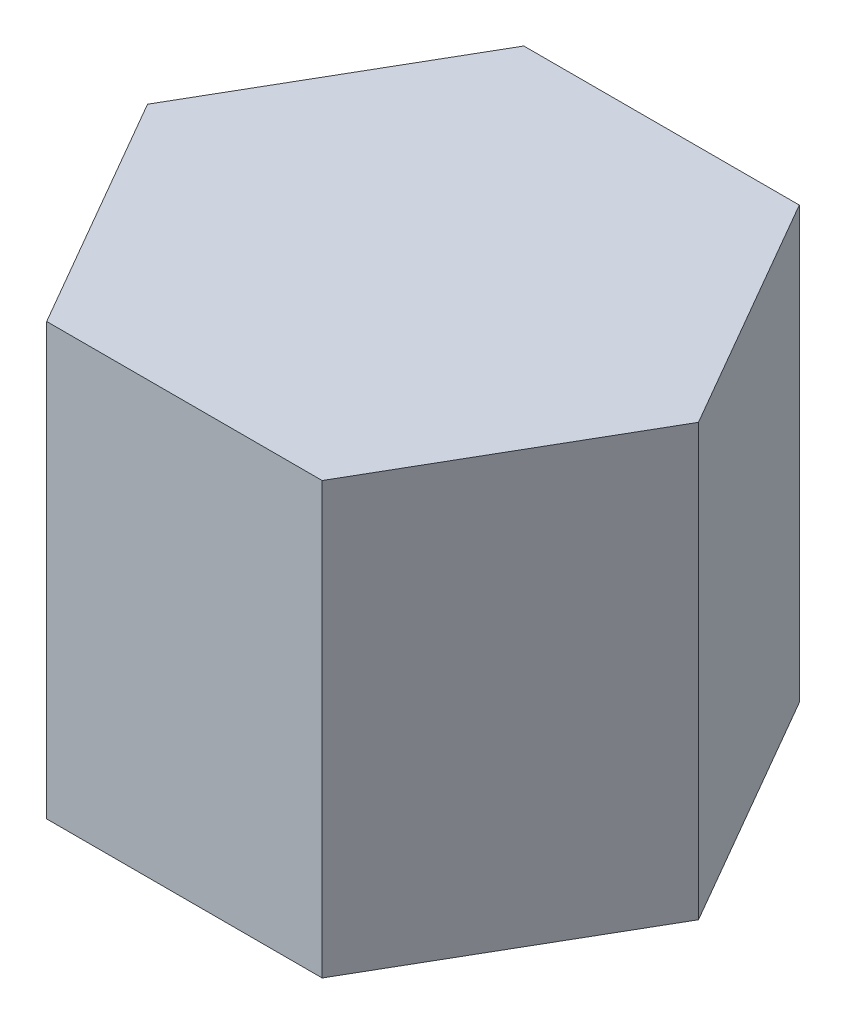
ISO-10303-21;
HEADER;
FILE_DESCRIPTION(('STEP AP214'),'2;1');
FILE_NAME('part.step','',(''),(''),'','','');
FILE_SCHEMA(('AUTOMOTIVE_DESIGN { 1 0 10303 214 1 1 1 1 }'));
ENDSEC;
DATA;
#1=APPLICATION_CONTEXT('core data for automotive mechanical design processes');
#2=APPLICATION_PROTOCOL_DEFINITION('international standard','automotive_design',2000,#1);
#3=PRODUCT_CONTEXT('',#1,'mechanical');
#4=PRODUCT('Part','Part','',(#3));
#5=PRODUCT_RELATED_PRODUCT_CATEGORY('part','',(#4));
#6=PRODUCT_DEFINITION_FORMATION('','',#4);
#7=PRODUCT_DEFINITION_CONTEXT('part definition',#1,'design');
#8=PRODUCT_DEFINITION('design','',#6,#7);
#9=PRODUCT_DEFINITION_SHAPE('','',#8);
#10=(LENGTH_UNIT() NAMED_UNIT(*) SI_UNIT(.MILLI.,.METRE.));
#11=(NAMED_UNIT(*) PLANE_ANGLE_UNIT() SI_UNIT($,.RADIAN.));
#12=(NAMED_UNIT(*) SI_UNIT($,.STERADIAN.) SOLID_ANGLE_UNIT());
#13=UNCERTAINTY_MEASURE_WITH_UNIT(LENGTH_MEASURE(1.E-05),#10,'distance_accuracy_value','');
#14=(GEOMETRIC_REPRESENTATION_CONTEXT(3) GLOBAL_UNCERTAINTY_ASSIGNED_CONTEXT((#13)) GLOBAL_UNIT_ASSIGNED_CONTEXT((#10,
#11,#12)) REPRESENTATION_CONTEXT('',''));
#15=CARTESIAN_POINT('',(0.,0.,0.));
#16=DIRECTION('',(0.,0.,1.));
#17=DIRECTION('',(1.,0.,0.));
#18=AXIS2_PLACEMENT_3D('',#15,#16,#17);
#19=CARTESIAN_POINT('',(-25.5766169251004,-80.,44.3));
#20=DIRECTION('',(0.,0.,1.));
#21=DIRECTION('',(1.,0.,0.));
#22=AXIS2_PLACEMENT_3D('',#19,#20,#21);
#23=PLANE('',#22);
#24=DIRECTION('',(1.,0.,0.));
#25=VECTOR('',#24,1.);
#26=CARTESIAN_POINT('',(-25.5766169251004,0.,44.3));
#27=LINE('',#26,#25);
#28=CARTESIAN_POINT('',(-25.5766169251004,0.,44.3));
#29=VERTEX_POINT('',#28);
#30=CARTESIAN_POINT('',(25.5766169251004,0.,44.3));
#31=VERTEX_POINT('',#30);
#32=EDGE_CURVE('E130',#29,#31,#27,.T.);
#33=ORIENTED_EDGE('',*,*,#32,.F.);
#34=DIRECTION('',(0.,1.,0.));
#35=VECTOR('',#34,1.);
#36=CARTESIAN_POINT('',(-25.5766169251004,-80.,44.3));
#37=LINE('',#36,#35);
#38=CARTESIAN_POINT('',(-25.5766169251004,-80.,44.3));
#39=VERTEX_POINT('',#38);
#40=EDGE_CURVE('E11',#39,#29,#37,.T.);
#41=ORIENTED_EDGE('',*,*,#40,.F.);
#42=DIRECTION('',(1.,0.,0.));
#43=VECTOR('',#42,1.);
#44=CARTESIAN_POINT('',(-25.5766169251004,-80.,44.3));
#45=LINE('',#44,#43);
#46=CARTESIAN_POINT('',(25.5766169251004,-80.,44.3));
#47=VERTEX_POINT('',#46);
#48=EDGE_CURVE('E150',#39,#47,#45,.T.);
#49=ORIENTED_EDGE('',*,*,#48,.T.);
#50=DIRECTION('',(0.,1.,0.));
#51=VECTOR('',#50,1.);
#52=CARTESIAN_POINT('',(25.5766169251004,-80.,44.3));
#53=LINE('',#52,#51);
#54=EDGE_CURVE('E42',#47,#31,#53,.T.);
#55=ORIENTED_EDGE('',*,*,#54,.T.);
#56=EDGE_LOOP('',(#33,#41,#49,#55));
#57=FACE_BOUND('',#56,.T.);
#58=ADVANCED_FACE('F39',(#57),#23,.T.);
#59=CARTESIAN_POINT('',(-51.1532338502008,-80.,0.));
#60=DIRECTION('',(-0.866025403784439,0.,0.5));
#61=DIRECTION('',(0.5,0.,0.866025403784439));
#62=AXIS2_PLACEMENT_3D('',#59,#60,#61);
#63=PLANE('',#62);
#64=DIRECTION('',(0.5,0.,0.866025403784438));
#65=VECTOR('',#64,1.);
#66=CARTESIAN_POINT('',(-51.1532338502008,0.,0.));
#67=LINE('',#66,#65);
#68=CARTESIAN_POINT('',(-51.1532338502008,0.,0.));
#69=VERTEX_POINT('',#68);
#70=EDGE_CURVE('E147',#69,#29,#67,.T.);
#71=ORIENTED_EDGE('',*,*,#70,.F.);
#72=DIRECTION('',(0.,1.,0.));
#73=VECTOR('',#72,1.);
#74=CARTESIAN_POINT('',(-51.1532338502008,-80.,0.));
#75=LINE('',#74,#73);
#76=CARTESIAN_POINT('',(-51.1532338502008,-80.,0.));
#77=VERTEX_POINT('',#76);
#78=EDGE_CURVE('E49',#77,#69,#75,.T.);
#79=ORIENTED_EDGE('',*,*,#78,.F.);
#80=DIRECTION('',(0.5,0.,0.866025403784438));
#81=VECTOR('',#80,1.);
#82=CARTESIAN_POINT('',(-51.1532338502008,-80.,0.));
#83=LINE('',#82,#81);
#84=EDGE_CURVE('E116',#77,#39,#83,.T.);
#85=ORIENTED_EDGE('',*,*,#84,.T.);
#86=ORIENTED_EDGE('',*,*,#40,.T.);
#87=EDGE_LOOP('',(#71,#79,#85,#86));
#88=FACE_BOUND('',#87,.T.);
#89=ADVANCED_FACE('F162',(#88),#63,.T.);
#90=CARTESIAN_POINT('',(-25.5766169251004,-80.,-44.3));
#91=DIRECTION('',(-0.866025403784439,0.,-0.499999999999999));
#92=DIRECTION('',(-0.499999999999999,0.,0.866025403784439));
#93=AXIS2_PLACEMENT_3D('',#90,#91,#92);
#94=PLANE('',#93);
#95=DIRECTION('',(-0.499999999999999,0.,0.866025403784439));
#96=VECTOR('',#95,1.);
#97=CARTESIAN_POINT('',(-25.5766169251004,0.,-44.3));
#98=LINE('',#97,#96);
#99=CARTESIAN_POINT('',(-25.5766169251004,0.,-44.3));
#100=VERTEX_POINT('',#99);
#101=EDGE_CURVE('E102',#100,#69,#98,.T.);
#102=ORIENTED_EDGE('',*,*,#101,.F.);
#103=DIRECTION('',(0.,1.,0.));
#104=VECTOR('',#103,1.);
#105=CARTESIAN_POINT('',(-25.5766169251004,-80.,-44.3));
#106=LINE('',#105,#104);
#107=CARTESIAN_POINT('',(-25.5766169251004,-80.,-44.3));
#108=VERTEX_POINT('',#107);
#109=EDGE_CURVE('E97',#108,#100,#106,.T.);
#110=ORIENTED_EDGE('',*,*,#109,.F.);
#111=DIRECTION('',(-0.499999999999999,0.,0.866025403784439));
#112=VECTOR('',#111,1.);
#113=CARTESIAN_POINT('',(-25.5766169251004,-80.,-44.3));
#114=LINE('',#113,#112);
#115=EDGE_CURVE('E100',#108,#77,#114,.T.);
#116=ORIENTED_EDGE('',*,*,#115,.T.);
#117=ORIENTED_EDGE('',*,*,#78,.T.);
#118=EDGE_LOOP('',(#102,#110,#116,#117));
#119=FACE_BOUND('',#118,.T.);
#120=ADVANCED_FACE('F99',(#119),#94,.T.);
#121=CARTESIAN_POINT('',(25.5766169251004,-80.,-44.3));
#122=DIRECTION('',(0.,0.,-1.));
#123=DIRECTION('',(-1.,0.,0.));
#124=AXIS2_PLACEMENT_3D('',#121,#122,#123);
#125=PLANE('',#124);
#126=DIRECTION('',(-1.,0.,0.));
#127=VECTOR('',#126,1.);
#128=CARTESIAN_POINT('',(25.5766169251004,0.,-44.3));
#129=LINE('',#128,#127);
#130=CARTESIAN_POINT('',(25.5766169251004,0.,-44.3));
#131=VERTEX_POINT('',#130);
#132=EDGE_CURVE('E142',#131,#100,#129,.T.);
#133=ORIENTED_EDGE('',*,*,#132,.F.);
#134=DIRECTION('',(0.,1.,0.));
#135=VECTOR('',#134,1.);
#136=CARTESIAN_POINT('',(25.5766169251004,-80.,-44.3));
#137=LINE('',#136,#135);
#138=CARTESIAN_POINT('',(25.5766169251004,-80.,-44.3));
#139=VERTEX_POINT('',#138);
#140=EDGE_CURVE('E108',#139,#131,#137,.T.);
#141=ORIENTED_EDGE('',*,*,#140,.F.);
#142=DIRECTION('',(-1.,0.,0.));
#143=VECTOR('',#142,1.);
#144=CARTESIAN_POINT('',(25.5766169251004,-80.,-44.3));
#145=LINE('',#144,#143);
#146=EDGE_CURVE('E114',#139,#108,#145,.T.);
#147=ORIENTED_EDGE('',*,*,#146,.T.);
#148=ORIENTED_EDGE('',*,*,#109,.T.);
#149=EDGE_LOOP('',(#133,#141,#147,#148));
#150=FACE_BOUND('',#149,.T.);
#151=ADVANCED_FACE('F119',(#150),#125,.T.);
#152=CARTESIAN_POINT('',(51.1532338502008,-80.,0.));
#153=DIRECTION('',(0.866025403784438,0.,-0.5));
#154=DIRECTION('',(-0.5,0.,-0.866025403784438));
#155=AXIS2_PLACEMENT_3D('',#152,#153,#154);
#156=PLANE('',#155);
#157=DIRECTION('',(-0.5,0.,-0.866025403784438));
#158=VECTOR('',#157,1.);
#159=CARTESIAN_POINT('',(51.1532338502008,0.,0.));
#160=LINE('',#159,#158);
#161=CARTESIAN_POINT('',(51.1532338502008,0.,0.));
#162=VERTEX_POINT('',#161);
#163=EDGE_CURVE('E138',#162,#131,#160,.T.);
#164=ORIENTED_EDGE('',*,*,#163,.F.);
#165=DIRECTION('',(0.,1.,0.));
#166=VECTOR('',#165,1.);
#167=CARTESIAN_POINT('',(51.1532338502008,-80.,0.));
#168=LINE('',#167,#166);
#169=CARTESIAN_POINT('',(51.1532338502008,-80.,0.));
#170=VERTEX_POINT('',#169);
#171=EDGE_CURVE('E155',#170,#162,#168,.T.);
#172=ORIENTED_EDGE('',*,*,#171,.F.);
#173=DIRECTION('',(-0.5,0.,-0.866025403784438));
#174=VECTOR('',#173,1.);
#175=CARTESIAN_POINT('',(51.1532338502008,-80.,0.));
#176=LINE('',#175,#174);
#177=EDGE_CURVE('E121',#170,#139,#176,.T.);
#178=ORIENTED_EDGE('',*,*,#177,.T.);
#179=ORIENTED_EDGE('',*,*,#140,.T.);
#180=EDGE_LOOP('',(#164,#172,#178,#179));
#181=FACE_BOUND('',#180,.T.);
#182=ADVANCED_FACE('F175',(#181),#156,.T.);
#183=CARTESIAN_POINT('',(25.5766169251004,-80.,44.3));
#184=DIRECTION('',(0.866025403784439,0.,0.5));
#185=DIRECTION('',(0.5,0.,-0.866025403784439));
#186=AXIS2_PLACEMENT_3D('',#183,#184,#185);
#187=PLANE('',#186);
#188=DIRECTION('',(0.5,0.,-0.866025403784439));
#189=VECTOR('',#188,1.);
#190=CARTESIAN_POINT('',(25.5766169251004,0.,44.3));
#191=LINE('',#190,#189);
#192=EDGE_CURVE('E134',#31,#162,#191,.T.);
#193=ORIENTED_EDGE('',*,*,#192,.F.);
#194=ORIENTED_EDGE('',*,*,#54,.F.);
#195=DIRECTION('',(0.5,0.,-0.866025403784439));
#196=VECTOR('',#195,1.);
#197=CARTESIAN_POINT('',(25.5766169251004,-80.,44.3));
#198=LINE('',#197,#196);
#199=EDGE_CURVE('E124',#47,#170,#198,.T.);
#200=ORIENTED_EDGE('',*,*,#199,.T.);
#201=ORIENTED_EDGE('',*,*,#171,.T.);
#202=EDGE_LOOP('',(#193,#194,#200,#201));
#203=FACE_BOUND('',#202,.T.);
#204=ADVANCED_FACE('F159',(#203),#187,.T.);
#205=CARTESIAN_POINT('',(0.,-80.,0.));
#206=DIRECTION('',(0.,1.,0.));
#207=DIRECTION('',(0.,0.,1.));
#208=AXIS2_PLACEMENT_3D('',#205,#206,#207);
#209=PLANE('',#208);
#210=ORIENTED_EDGE('',*,*,#48,.F.);
#211=ORIENTED_EDGE('',*,*,#84,.F.);
#212=ORIENTED_EDGE('',*,*,#115,.F.);
#213=ORIENTED_EDGE('',*,*,#146,.F.);
#214=ORIENTED_EDGE('',*,*,#177,.F.);
#215=ORIENTED_EDGE('',*,*,#199,.F.);
#216=EDGE_LOOP('',(#210,#211,#212,#213,#214,#215));
#217=FACE_BOUND('',#216,.T.);
#218=ADVANCED_FACE('F112',(#217),#209,.F.);
#219=CARTESIAN_POINT('',(0.,0.,0.));
#220=DIRECTION('',(0.,1.,0.));
#221=DIRECTION('',(0.,0.,1.));
#222=AXIS2_PLACEMENT_3D('',#219,#220,#221);
#223=PLANE('',#222);
#224=ORIENTED_EDGE('',*,*,#32,.T.);
#225=ORIENTED_EDGE('',*,*,#192,.T.);
#226=ORIENTED_EDGE('',*,*,#163,.T.);
#227=ORIENTED_EDGE('',*,*,#132,.T.);
#228=ORIENTED_EDGE('',*,*,#101,.T.);
#229=ORIENTED_EDGE('',*,*,#70,.T.);
#230=EDGE_LOOP('',(#224,#225,#226,#227,#228,#229));
#231=FACE_BOUND('',#230,.T.);
#232=ADVANCED_FACE('F161',(#231),#223,.T.);
#233=CLOSED_SHELL('',(#58,#89,#120,#151,#182,#204,#218,#232));
#234=MANIFOLD_SOLID_BREP('B2',#233);
#235=ADVANCED_BREP_SHAPE_REPRESENTATION('',(#18,#234),#14);
#236=SHAPE_DEFINITION_REPRESENTATION(#9,#235);
ENDSEC;
END-ISO-10303-21;
